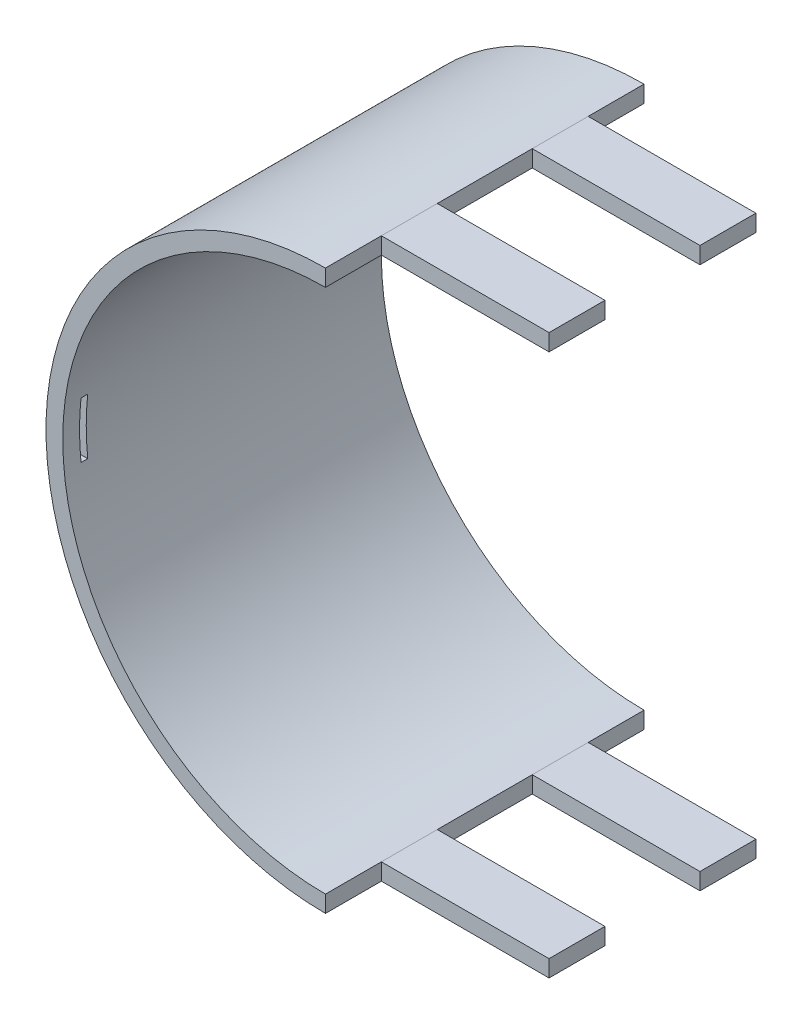
ISO-10303-21;
HEADER;
FILE_DESCRIPTION(('STEP AP214'),'2;1');
FILE_NAME('part.step','',(''),(''),'','','');
FILE_SCHEMA(('AUTOMOTIVE_DESIGN { 1 0 10303 214 1 1 1 1 }'));
ENDSEC;
DATA;
#1=APPLICATION_CONTEXT('core data for automotive mechanical design processes');
#2=APPLICATION_PROTOCOL_DEFINITION('international standard','automotive_design',2000,#1);
#3=PRODUCT_CONTEXT('',#1,'mechanical');
#4=PRODUCT('Part','Part','',(#3));
#5=PRODUCT_RELATED_PRODUCT_CATEGORY('part','',(#4));
#6=PRODUCT_DEFINITION_FORMATION('','',#4);
#7=PRODUCT_DEFINITION_CONTEXT('part definition',#1,'design');
#8=PRODUCT_DEFINITION('design','',#6,#7);
#9=PRODUCT_DEFINITION_SHAPE('','',#8);
#10=(LENGTH_UNIT() NAMED_UNIT(*) SI_UNIT(.MILLI.,.METRE.));
#11=(NAMED_UNIT(*) PLANE_ANGLE_UNIT() SI_UNIT($,.RADIAN.));
#12=(NAMED_UNIT(*) SI_UNIT($,.STERADIAN.) SOLID_ANGLE_UNIT());
#13=UNCERTAINTY_MEASURE_WITH_UNIT(LENGTH_MEASURE(1.E-05),#10,'distance_accuracy_value','');
#14=(GEOMETRIC_REPRESENTATION_CONTEXT(3) GLOBAL_UNCERTAINTY_ASSIGNED_CONTEXT((#13)) GLOBAL_UNIT_ASSIGNED_CONTEXT((#10,
#11,#12)) REPRESENTATION_CONTEXT('',''));
#15=CARTESIAN_POINT('',(0.,0.,0.));
#16=DIRECTION('',(0.,0.,1.));
#17=DIRECTION('',(1.,0.,0.));
#18=AXIS2_PLACEMENT_3D('',#15,#16,#17);
#19=CARTESIAN_POINT('',(-269.99,-4.99999999999996,55.8));
#20=DIRECTION('',(0.,-1.,0.));
#21=DIRECTION('',(0.,0.,-1.));
#22=AXIS2_PLACEMENT_3D('',#19,#20,#21);
#23=PLANE('',#22);
#24=DIRECTION('',(-1.,0.,0.));
#25=VECTOR('',#24,1.);
#26=CARTESIAN_POINT('',(-269.99,-4.99999999999996,55.8));
#27=LINE('',#26,#25);
#28=CARTESIAN_POINT('',(-346.733285782192,-4.99999999999995,55.8));
#29=VERTEX_POINT('',#28);
#30=CARTESIAN_POINT('',(-349.749371855331,-4.99999999999994,55.8));
#31=VERTEX_POINT('',#30);
#32=EDGE_CURVE('E386',#29,#31,#27,.T.);
#33=ORIENTED_EDGE('',*,*,#32,.T.);
#34=DIRECTION('',(0.,0.,-1.));
#35=VECTOR('',#34,1.);
#36=CARTESIAN_POINT('',(-349.749371855331,-4.99999999999994,60.));
#37=LINE('',#36,#35);
#38=CARTESIAN_POINT('',(-349.749371855331,-4.99999999999994,57.));
#39=VERTEX_POINT('',#38);
#40=EDGE_CURVE('E52',#39,#31,#37,.T.);
#41=ORIENTED_EDGE('',*,*,#40,.F.);
#42=DIRECTION('',(-1.,0.,0.));
#43=VECTOR('',#42,1.);
#44=CARTESIAN_POINT('',(-269.99,-4.99999999999995,57.));
#45=LINE('',#44,#43);
#46=CARTESIAN_POINT('',(-346.733285782192,-4.99999999999994,57.));
#47=VERTEX_POINT('',#46);
#48=EDGE_CURVE('E382',#47,#39,#45,.T.);
#49=ORIENTED_EDGE('',*,*,#48,.F.);
#50=DIRECTION('',(0.,0.,1.));
#51=VECTOR('',#50,1.);
#52=CARTESIAN_POINT('',(-346.733285782192,-5.00000000000006,3.00000000000001));
#53=LINE('',#52,#51);
#54=EDGE_CURVE('E39',#29,#47,#53,.T.);
#55=ORIENTED_EDGE('',*,*,#54,.F.);
#56=EDGE_LOOP('',(#33,#41,#49,#55));
#57=FACE_BOUND('',#56,.T.);
#58=ADVANCED_FACE('F35',(#57),#23,.F.);
#59=CARTESIAN_POINT('',(-269.99,0.,55.8));
#60=DIRECTION('',(0.,0.,-1.));
#61=DIRECTION('',(0.,1.,0.));
#62=AXIS2_PLACEMENT_3D('',#59,#60,#61);
#63=PLANE('',#62);
#64=DIRECTION('',(-1.,0.,0.));
#65=VECTOR('',#64,1.);
#66=CARTESIAN_POINT('',(-269.99,5.00000000000004,55.8));
#67=LINE('',#66,#65);
#68=CARTESIAN_POINT('',(-346.733285782192,5.00000000000017,55.8));
#69=VERTEX_POINT('',#68);
#70=CARTESIAN_POINT('',(-349.749371855331,5.00000000000006,55.8));
#71=VERTEX_POINT('',#70);
#72=EDGE_CURVE('E44',#69,#71,#67,.T.);
#73=ORIENTED_EDGE('',*,*,#72,.T.);
#74=CARTESIAN_POINT('',(-300.,0.,55.8));
#75=DIRECTION('',(0.,0.,-1.));
#76=DIRECTION('',(0.,1.,0.));
#77=AXIS2_PLACEMENT_3D('',#74,#75,#76);
#78=CIRCLE('',#77,50.);
#79=EDGE_CURVE('E378',#31,#71,#78,.T.);
#80=ORIENTED_EDGE('',*,*,#79,.F.);
#81=ORIENTED_EDGE('',*,*,#32,.F.);
#82=CARTESIAN_POINT('',(-300.,0.,55.8));
#83=DIRECTION('',(0.,0.,-1.));
#84=DIRECTION('',(0.,1.,0.));
#85=AXIS2_PLACEMENT_3D('',#82,#83,#84);
#86=CIRCLE('',#85,47.);
#87=EDGE_CURVE('E394',#69,#29,#86,.F.);
#88=ORIENTED_EDGE('',*,*,#87,.F.);
#89=EDGE_LOOP('',(#73,#80,#81,#88));
#90=FACE_BOUND('',#89,.T.);
#91=ADVANCED_FACE('F37',(#90),#63,.F.);
#92=CARTESIAN_POINT('',(-269.99,0.,57.));
#93=DIRECTION('',(0.,0.,1.));
#94=DIRECTION('',(1.,0.,0.));
#95=AXIS2_PLACEMENT_3D('',#92,#93,#94);
#96=PLANE('',#95);
#97=ORIENTED_EDGE('',*,*,#48,.T.);
#98=CARTESIAN_POINT('',(-300.,0.,57.));
#99=DIRECTION('',(0.,0.,1.));
#100=DIRECTION('',(1.,0.,0.));
#101=AXIS2_PLACEMENT_3D('',#98,#99,#100);
#102=CIRCLE('',#101,50.);
#103=CARTESIAN_POINT('',(-349.749371855331,5.00000000000005,57.));
#104=VERTEX_POINT('',#103);
#105=EDGE_CURVE('E360',#104,#39,#102,.T.);
#106=ORIENTED_EDGE('',*,*,#105,.F.);
#107=DIRECTION('',(-1.,0.,0.));
#108=VECTOR('',#107,1.);
#109=CARTESIAN_POINT('',(-269.99,5.00000000000004,57.));
#110=LINE('',#109,#108);
#111=CARTESIAN_POINT('',(-346.733285782192,5.00000000000017,57.));
#112=VERTEX_POINT('',#111);
#113=EDGE_CURVE('E11',#112,#104,#110,.T.);
#114=ORIENTED_EDGE('',*,*,#113,.F.);
#115=CARTESIAN_POINT('',(-300.,0.,57.));
#116=DIRECTION('',(0.,0.,1.));
#117=DIRECTION('',(1.,0.,0.));
#118=AXIS2_PLACEMENT_3D('',#115,#116,#117);
#119=CIRCLE('',#118,47.);
#120=EDGE_CURVE('E393',#47,#112,#119,.F.);
#121=ORIENTED_EDGE('',*,*,#120,.F.);
#122=EDGE_LOOP('',(#97,#106,#114,#121));
#123=FACE_BOUND('',#122,.T.);
#124=ADVANCED_FACE('F404',(#123),#96,.F.);
#125=CARTESIAN_POINT('',(-269.99,5.00000000000004,55.8));
#126=DIRECTION('',(0.,1.,0.));
#127=DIRECTION('',(0.,0.,1.));
#128=AXIS2_PLACEMENT_3D('',#125,#126,#127);
#129=PLANE('',#128);
#130=ORIENTED_EDGE('',*,*,#113,.T.);
#131=DIRECTION('',(0.,0.,-1.));
#132=VECTOR('',#131,1.);
#133=CARTESIAN_POINT('',(-349.749371855331,5.00000000000005,60.));
#134=LINE('',#133,#132);
#135=EDGE_CURVE('E388',#104,#71,#134,.T.);
#136=ORIENTED_EDGE('',*,*,#135,.T.);
#137=ORIENTED_EDGE('',*,*,#72,.F.);
#138=DIRECTION('',(0.,0.,1.));
#139=VECTOR('',#138,1.);
#140=CARTESIAN_POINT('',(-346.733285782192,5.00000000000017,3.00000000000001));
#141=LINE('',#140,#139);
#142=EDGE_CURVE('E380',#112,#69,#141,.F.);
#143=ORIENTED_EDGE('',*,*,#142,.F.);
#144=EDGE_LOOP('',(#130,#136,#137,#143));
#145=FACE_BOUND('',#144,.T.);
#146=ADVANCED_FACE('F414',(#145),#129,.F.);
#147=CARTESIAN_POINT('',(-300.,0.,60.));
#148=DIRECTION('',(0.,0.,-1.));
#149=DIRECTION('',(-1.,0.,0.));
#150=AXIS2_PLACEMENT_3D('',#147,#148,#149);
#151=CYLINDRICAL_SURFACE('',#150,50.);
#152=DIRECTION('',(0.,0.,-1.));
#153=VECTOR('',#152,1.);
#154=CARTESIAN_POINT('',(-300.,50.,60.));
#155=LINE('',#154,#153);
#156=CARTESIAN_POINT('',(-300.,50.,60.));
#157=VERTEX_POINT('',#156);
#158=CARTESIAN_POINT('',(-300.,50.,50.));
#159=VERTEX_POINT('',#158);
#160=EDGE_CURVE('E239',#157,#159,#155,.T.);
#161=ORIENTED_EDGE('',*,*,#160,.T.);
#162=DIRECTION('',(0.,0.,-1.));
#163=VECTOR('',#162,1.);
#164=CARTESIAN_POINT('',(-300.,50.,60.));
#165=LINE('',#164,#163);
#166=CARTESIAN_POINT('',(-300.,50.,40.));
#167=VERTEX_POINT('',#166);
#168=EDGE_CURVE('E343',#159,#167,#165,.T.);
#169=ORIENTED_EDGE('',*,*,#168,.T.);
#170=CARTESIAN_POINT('',(-300.,50.,23.));
#171=VERTEX_POINT('',#170);
#172=EDGE_CURVE('E262',#167,#171,#155,.T.);
#173=ORIENTED_EDGE('',*,*,#172,.T.);
#174=DIRECTION('',(0.,0.,-1.));
#175=VECTOR('',#174,1.);
#176=CARTESIAN_POINT('',(-300.,50.,60.));
#177=LINE('',#176,#175);
#178=CARTESIAN_POINT('',(-300.,50.,13.));
#179=VERTEX_POINT('',#178);
#180=EDGE_CURVE('E309',#171,#179,#177,.T.);
#181=ORIENTED_EDGE('',*,*,#180,.T.);
#182=CARTESIAN_POINT('',(-300.,50.,3.));
#183=VERTEX_POINT('',#182);
#184=EDGE_CURVE('E259',#179,#183,#155,.T.);
#185=ORIENTED_EDGE('',*,*,#184,.T.);
#186=CARTESIAN_POINT('',(-300.,0.,3.));
#187=DIRECTION('',(0.,0.,1.));
#188=DIRECTION('',(1.,0.,0.));
#189=AXIS2_PLACEMENT_3D('',#186,#187,#188);
#190=CIRCLE('',#189,50.);
#191=CARTESIAN_POINT('',(-300.,-50.,3.));
#192=VERTEX_POINT('',#191);
#193=EDGE_CURVE('E243',#183,#192,#190,.T.);
#194=ORIENTED_EDGE('',*,*,#193,.T.);
#195=DIRECTION('',(0.,0.,-1.));
#196=VECTOR('',#195,1.);
#197=CARTESIAN_POINT('',(-300.,-50.,60.));
#198=LINE('',#197,#196);
#199=CARTESIAN_POINT('',(-300.,-50.,13.));
#200=VERTEX_POINT('',#199);
#201=EDGE_CURVE('E250',#200,#192,#198,.T.);
#202=ORIENTED_EDGE('',*,*,#201,.F.);
#203=DIRECTION('',(0.,0.,-1.));
#204=VECTOR('',#203,1.);
#205=CARTESIAN_POINT('',(-300.,-50.,60.));
#206=LINE('',#205,#204);
#207=CARTESIAN_POINT('',(-300.,-50.,23.));
#208=VERTEX_POINT('',#207);
#209=EDGE_CURVE('E225',#208,#200,#206,.T.);
#210=ORIENTED_EDGE('',*,*,#209,.F.);
#211=CARTESIAN_POINT('',(-300.,-50.,40.));
#212=VERTEX_POINT('',#211);
#213=EDGE_CURVE('E249',#212,#208,#198,.T.);
#214=ORIENTED_EDGE('',*,*,#213,.F.);
#215=DIRECTION('',(0.,0.,-1.));
#216=VECTOR('',#215,1.);
#217=CARTESIAN_POINT('',(-300.,-50.,60.));
#218=LINE('',#217,#216);
#219=CARTESIAN_POINT('',(-300.,-50.,50.));
#220=VERTEX_POINT('',#219);
#221=EDGE_CURVE('E290',#220,#212,#218,.T.);
#222=ORIENTED_EDGE('',*,*,#221,.F.);
#223=CARTESIAN_POINT('',(-300.,-50.,60.));
#224=VERTEX_POINT('',#223);
#225=EDGE_CURVE('E245',#224,#220,#198,.T.);
#226=ORIENTED_EDGE('',*,*,#225,.F.);
#227=CARTESIAN_POINT('',(-300.,0.,60.));
#228=DIRECTION('',(0.,0.,1.));
#229=DIRECTION('',(1.,0.,0.));
#230=AXIS2_PLACEMENT_3D('',#227,#228,#229);
#231=CIRCLE('',#230,50.);
#232=EDGE_CURVE('E235',#157,#224,#231,.T.);
#233=ORIENTED_EDGE('',*,*,#232,.F.);
#234=EDGE_LOOP('',(#161,#169,#173,#181,#185,#194,#202,#210,#214,#222,#226,#233));
#235=FACE_BOUND('',#234,.T.);
#236=ORIENTED_EDGE('',*,*,#79,.T.);
#237=ORIENTED_EDGE('',*,*,#135,.F.);
#238=ORIENTED_EDGE('',*,*,#105,.T.);
#239=ORIENTED_EDGE('',*,*,#40,.T.);
#240=EDGE_LOOP('',(#236,#237,#238,#239));
#241=FACE_BOUND('',#240,.T.);
#242=ADVANCED_FACE('F417',(#235,#241),#151,.T.);
#243=CARTESIAN_POINT('',(-300.,-47.,3.));
#244=DIRECTION('',(0.,-1.,0.));
#245=DIRECTION('',(0.,0.,-1.));
#246=AXIS2_PLACEMENT_3D('',#243,#244,#245);
#247=PLANE('',#246);
#248=DIRECTION('',(-1.,0.,0.));
#249=VECTOR('',#248,1.);
#250=CARTESIAN_POINT('',(-300.,-47.,23.));
#251=LINE('',#250,#249);
#252=CARTESIAN_POINT('',(-270.,-47.,23.));
#253=VERTEX_POINT('',#252);
#254=CARTESIAN_POINT('',(-300.,-47.,23.));
#255=VERTEX_POINT('',#254);
#256=EDGE_CURVE('E229',#253,#255,#251,.T.);
#257=ORIENTED_EDGE('',*,*,#256,.F.);
#258=DIRECTION('',(0.,0.,1.));
#259=VECTOR('',#258,1.);
#260=CARTESIAN_POINT('',(-270.,-47.,3.));
#261=LINE('',#260,#259);
#262=CARTESIAN_POINT('',(-270.,-47.,13.));
#263=VERTEX_POINT('',#262);
#264=EDGE_CURVE('E201',#263,#253,#261,.T.);
#265=ORIENTED_EDGE('',*,*,#264,.F.);
#266=DIRECTION('',(1.,0.,0.));
#267=VECTOR('',#266,1.);
#268=CARTESIAN_POINT('',(-300.,-47.,13.));
#269=LINE('',#268,#267);
#270=CARTESIAN_POINT('',(-300.,-47.,13.));
#271=VERTEX_POINT('',#270);
#272=EDGE_CURVE('E232',#271,#263,#269,.T.);
#273=ORIENTED_EDGE('',*,*,#272,.F.);
#274=DIRECTION('',(0.,0.,1.));
#275=VECTOR('',#274,1.);
#276=CARTESIAN_POINT('',(-300.,-47.,3.));
#277=LINE('',#276,#275);
#278=EDGE_CURVE('E206',#271,#255,#277,.T.);
#279=ORIENTED_EDGE('',*,*,#278,.T.);
#280=EDGE_LOOP('',(#257,#265,#273,#279));
#281=FACE_BOUND('',#280,.T.);
#282=ADVANCED_FACE('F465',(#281),#247,.F.);
#283=CARTESIAN_POINT('',(-300.,-47.,3.));
#284=DIRECTION('',(0.,-1.,0.));
#285=DIRECTION('',(0.,0.,-1.));
#286=AXIS2_PLACEMENT_3D('',#283,#284,#285);
#287=PLANE('',#286);
#288=DIRECTION('',(-1.,0.,0.));
#289=VECTOR('',#288,1.);
#290=CARTESIAN_POINT('',(-300.,-47.,50.));
#291=LINE('',#290,#289);
#292=CARTESIAN_POINT('',(-270.,-47.,50.));
#293=VERTEX_POINT('',#292);
#294=CARTESIAN_POINT('',(-300.,-47.,50.));
#295=VERTEX_POINT('',#294);
#296=EDGE_CURVE('E302',#293,#295,#291,.T.);
#297=ORIENTED_EDGE('',*,*,#296,.F.);
#298=DIRECTION('',(0.,0.,1.));
#299=VECTOR('',#298,1.);
#300=CARTESIAN_POINT('',(-270.,-47.,3.));
#301=LINE('',#300,#299);
#302=CARTESIAN_POINT('',(-270.,-47.,40.));
#303=VERTEX_POINT('',#302);
#304=EDGE_CURVE('E304',#303,#293,#301,.T.);
#305=ORIENTED_EDGE('',*,*,#304,.F.);
#306=DIRECTION('',(1.,0.,0.));
#307=VECTOR('',#306,1.);
#308=CARTESIAN_POINT('',(-300.,-47.,40.));
#309=LINE('',#308,#307);
#310=CARTESIAN_POINT('',(-300.,-47.,40.));
#311=VERTEX_POINT('',#310);
#312=EDGE_CURVE('E275',#311,#303,#309,.T.);
#313=ORIENTED_EDGE('',*,*,#312,.F.);
#314=DIRECTION('',(0.,0.,1.));
#315=VECTOR('',#314,1.);
#316=CARTESIAN_POINT('',(-300.,-47.,3.));
#317=LINE('',#316,#315);
#318=EDGE_CURVE('E282',#311,#295,#317,.T.);
#319=ORIENTED_EDGE('',*,*,#318,.T.);
#320=EDGE_LOOP('',(#297,#305,#313,#319));
#321=FACE_BOUND('',#320,.T.);
#322=ADVANCED_FACE('F438',(#321),#287,.F.);
#323=CARTESIAN_POINT('',(300.,47.,3.));
#324=DIRECTION('',(0.,1.,0.));
#325=DIRECTION('',(0.,0.,1.));
#326=AXIS2_PLACEMENT_3D('',#323,#324,#325);
#327=PLANE('',#326);
#328=DIRECTION('',(1.,0.,0.));
#329=VECTOR('',#328,1.);
#330=CARTESIAN_POINT('',(300.,47.,50.));
#331=LINE('',#330,#329);
#332=CARTESIAN_POINT('',(-300.,47.,50.));
#333=VERTEX_POINT('',#332);
#334=CARTESIAN_POINT('',(-270.,47.,50.));
#335=VERTEX_POINT('',#334);
#336=EDGE_CURVE('E356',#333,#335,#331,.T.);
#337=ORIENTED_EDGE('',*,*,#336,.F.);
#338=DIRECTION('',(0.,0.,1.));
#339=VECTOR('',#338,1.);
#340=CARTESIAN_POINT('',(-300.,47.,3.));
#341=LINE('',#340,#339);
#342=CARTESIAN_POINT('',(-300.,47.,39.9999999999999));
#343=VERTEX_POINT('',#342);
#344=EDGE_CURVE('E346',#343,#333,#341,.T.);
#345=ORIENTED_EDGE('',*,*,#344,.F.);
#346=DIRECTION('',(-1.,0.,0.));
#347=VECTOR('',#346,1.);
#348=CARTESIAN_POINT('',(300.,47.,40.));
#349=LINE('',#348,#347);
#350=CARTESIAN_POINT('',(-270.,47.,40.));
#351=VERTEX_POINT('',#350);
#352=EDGE_CURVE('E366',#351,#343,#349,.T.);
#353=ORIENTED_EDGE('',*,*,#352,.F.);
#354=DIRECTION('',(0.,0.,-1.));
#355=VECTOR('',#354,1.);
#356=CARTESIAN_POINT('',(-270.,47.,3.));
#357=LINE('',#356,#355);
#358=EDGE_CURVE('E371',#335,#351,#357,.T.);
#359=ORIENTED_EDGE('',*,*,#358,.F.);
#360=EDGE_LOOP('',(#337,#345,#353,#359));
#361=FACE_BOUND('',#360,.T.);
#362=ADVANCED_FACE('F434',(#361),#327,.F.);
#363=CARTESIAN_POINT('',(300.,47.,3.));
#364=DIRECTION('',(0.,1.,0.));
#365=DIRECTION('',(0.,0.,1.));
#366=AXIS2_PLACEMENT_3D('',#363,#364,#365);
#367=PLANE('',#366);
#368=DIRECTION('',(1.,0.,0.));
#369=VECTOR('',#368,1.);
#370=CARTESIAN_POINT('',(300.,47.,22.9999999999999));
#371=LINE('',#370,#369);
#372=CARTESIAN_POINT('',(-300.,47.,23.));
#373=VERTEX_POINT('',#372);
#374=CARTESIAN_POINT('',(-270.,47.,23.));
#375=VERTEX_POINT('',#374);
#376=EDGE_CURVE('E331',#373,#375,#371,.T.);
#377=ORIENTED_EDGE('',*,*,#376,.F.);
#378=DIRECTION('',(0.,0.,1.));
#379=VECTOR('',#378,1.);
#380=CARTESIAN_POINT('',(-300.,47.,3.));
#381=LINE('',#380,#379);
#382=CARTESIAN_POINT('',(-300.,47.,13.));
#383=VERTEX_POINT('',#382);
#384=EDGE_CURVE('E313',#383,#373,#381,.T.);
#385=ORIENTED_EDGE('',*,*,#384,.F.);
#386=DIRECTION('',(-1.,0.,0.));
#387=VECTOR('',#386,1.);
#388=CARTESIAN_POINT('',(300.,47.,13.));
#389=LINE('',#388,#387);
#390=CARTESIAN_POINT('',(-270.,47.,13.));
#391=VERTEX_POINT('',#390);
#392=EDGE_CURVE('E325',#391,#383,#389,.T.);
#393=ORIENTED_EDGE('',*,*,#392,.F.);
#394=DIRECTION('',(0.,0.,-1.));
#395=VECTOR('',#394,1.);
#396=CARTESIAN_POINT('',(-270.,47.,3.));
#397=LINE('',#396,#395);
#398=EDGE_CURVE('E328',#375,#391,#397,.T.);
#399=ORIENTED_EDGE('',*,*,#398,.F.);
#400=EDGE_LOOP('',(#377,#385,#393,#399));
#401=FACE_BOUND('',#400,.T.);
#402=ADVANCED_FACE('F437',(#401),#367,.F.);
#403=CARTESIAN_POINT('',(-300.,46.99,13.));
#404=DIRECTION('',(0.,0.,-1.));
#405=DIRECTION('',(-1.,0.,0.));
#406=AXIS2_PLACEMENT_3D('',#403,#404,#405);
#407=PLANE('',#406);
#408=DIRECTION('',(0.,1.,0.));
#409=VECTOR('',#408,1.);
#410=CARTESIAN_POINT('',(-270.,46.99,13.));
#411=LINE('',#410,#409);
#412=CARTESIAN_POINT('',(-270.,50.,13.));
#413=VERTEX_POINT('',#412);
#414=EDGE_CURVE('E340',#391,#413,#411,.T.);
#415=ORIENTED_EDGE('',*,*,#414,.F.);
#416=ORIENTED_EDGE('',*,*,#392,.T.);
#417=DIRECTION('',(0.,-1.,0.));
#418=VECTOR('',#417,1.);
#419=CARTESIAN_POINT('',(-300.,0.,13.));
#420=LINE('',#419,#418);
#421=EDGE_CURVE('E316',#179,#383,#420,.T.);
#422=ORIENTED_EDGE('',*,*,#421,.F.);
#423=DIRECTION('',(1.,0.,0.));
#424=VECTOR('',#423,1.);
#425=CARTESIAN_POINT('',(-300.,50.,13.));
#426=LINE('',#425,#424);
#427=EDGE_CURVE('E279',#179,#413,#426,.T.);
#428=ORIENTED_EDGE('',*,*,#427,.T.);
#429=EDGE_LOOP('',(#415,#416,#422,#428));
#430=FACE_BOUND('',#429,.T.);
#431=ADVANCED_FACE('F445',(#430),#407,.T.);
#432=CARTESIAN_POINT('',(-300.,0.,0.));
#433=DIRECTION('',(-1.,0.,0.));
#434=DIRECTION('',(0.,0.,1.));
#435=AXIS2_PLACEMENT_3D('',#432,#433,#434);
#436=PLANE('',#435);
#437=ORIENTED_EDGE('',*,*,#184,.F.);
#438=ORIENTED_EDGE('',*,*,#421,.T.);
#439=DIRECTION('',(0.,0.,1.));
#440=VECTOR('',#439,1.);
#441=CARTESIAN_POINT('',(-300.,47.,3.));
#442=LINE('',#441,#440);
#443=CARTESIAN_POINT('',(-300.,47.,3.));
#444=VERTEX_POINT('',#443);
#445=EDGE_CURVE('E244',#444,#383,#442,.T.);
#446=ORIENTED_EDGE('',*,*,#445,.F.);
#447=DIRECTION('',(0.,1.,0.));
#448=VECTOR('',#447,1.);
#449=CARTESIAN_POINT('',(-300.,0.,3.));
#450=LINE('',#449,#448);
#451=EDGE_CURVE('E272',#444,#183,#450,.T.);
#452=ORIENTED_EDGE('',*,*,#451,.T.);
#453=EDGE_LOOP('',(#437,#438,#446,#452));
#454=FACE_BOUND('',#453,.T.);
#455=ADVANCED_FACE('F461',(#454),#436,.F.);
#456=CARTESIAN_POINT('',(-270.,-50.01,40.));
#457=DIRECTION('',(1.,0.,0.));
#458=DIRECTION('',(0.,0.,-1.));
#459=AXIS2_PLACEMENT_3D('',#456,#457,#458);
#460=PLANE('',#459);
#461=DIRECTION('',(0.,1.,0.));
#462=VECTOR('',#461,1.);
#463=CARTESIAN_POINT('',(-270.,-50.01,50.));
#464=LINE('',#463,#462);
#465=CARTESIAN_POINT('',(-270.,-50.,50.));
#466=VERTEX_POINT('',#465);
#467=EDGE_CURVE('E280',#466,#293,#464,.T.);
#468=ORIENTED_EDGE('',*,*,#467,.F.);
#469=DIRECTION('',(0.,0.,-1.));
#470=VECTOR('',#469,1.);
#471=CARTESIAN_POINT('',(-270.,-50.,60.));
#472=LINE('',#471,#470);
#473=CARTESIAN_POINT('',(-270.,-50.,40.));
#474=VERTEX_POINT('',#473);
#475=EDGE_CURVE('E296',#466,#474,#472,.T.);
#476=ORIENTED_EDGE('',*,*,#475,.T.);
#477=DIRECTION('',(0.,1.,0.));
#478=VECTOR('',#477,1.);
#479=CARTESIAN_POINT('',(-270.,-50.01,40.));
#480=LINE('',#479,#478);
#481=EDGE_CURVE('E277',#474,#303,#480,.T.);
#482=ORIENTED_EDGE('',*,*,#481,.T.);
#483=ORIENTED_EDGE('',*,*,#304,.T.);
#484=EDGE_LOOP('',(#468,#476,#482,#483));
#485=FACE_BOUND('',#484,.T.);
#486=ADVANCED_FACE('F472',(#485),#460,.T.);
#487=CARTESIAN_POINT('',(-300.,-50.01,40.));
#488=DIRECTION('',(0.,0.,-1.));
#489=DIRECTION('',(-1.,0.,0.));
#490=AXIS2_PLACEMENT_3D('',#487,#488,#489);
#491=PLANE('',#490);
#492=ORIENTED_EDGE('',*,*,#481,.F.);
#493=DIRECTION('',(-1.,0.,0.));
#494=VECTOR('',#493,1.);
#495=CARTESIAN_POINT('',(-300.,-50.,40.));
#496=LINE('',#495,#494);
#497=EDGE_CURVE('E299',#474,#212,#496,.T.);
#498=ORIENTED_EDGE('',*,*,#497,.T.);
#499=DIRECTION('',(0.,-1.,0.));
#500=VECTOR('',#499,1.);
#501=CARTESIAN_POINT('',(-300.,0.,40.));
#502=LINE('',#501,#500);
#503=EDGE_CURVE('E286',#311,#212,#502,.T.);
#504=ORIENTED_EDGE('',*,*,#503,.F.);
#505=ORIENTED_EDGE('',*,*,#312,.T.);
#506=EDGE_LOOP('',(#492,#498,#504,#505));
#507=FACE_BOUND('',#506,.T.);
#508=ADVANCED_FACE('F475',(#507),#491,.T.);
#509=CARTESIAN_POINT('',(-300.,-50.01,50.));
#510=DIRECTION('',(0.,0.,1.));
#511=DIRECTION('',(1.,0.,0.));
#512=AXIS2_PLACEMENT_3D('',#509,#510,#511);
#513=PLANE('',#512);
#514=DIRECTION('',(0.,1.,0.));
#515=VECTOR('',#514,1.);
#516=CARTESIAN_POINT('',(-300.,0.,50.));
#517=LINE('',#516,#515);
#518=EDGE_CURVE('E283',#220,#295,#517,.T.);
#519=ORIENTED_EDGE('',*,*,#518,.F.);
#520=DIRECTION('',(1.,0.,0.));
#521=VECTOR('',#520,1.);
#522=CARTESIAN_POINT('',(-300.,-50.,50.));
#523=LINE('',#522,#521);
#524=EDGE_CURVE('E287',#220,#466,#523,.T.);
#525=ORIENTED_EDGE('',*,*,#524,.T.);
#526=ORIENTED_EDGE('',*,*,#467,.T.);
#527=ORIENTED_EDGE('',*,*,#296,.T.);
#528=EDGE_LOOP('',(#519,#525,#526,#527));
#529=FACE_BOUND('',#528,.T.);
#530=ADVANCED_FACE('F479',(#529),#513,.T.);
#531=CARTESIAN_POINT('',(0.,0.,3.));
#532=DIRECTION('',(0.,0.,1.));
#533=DIRECTION('',(1.,0.,0.));
#534=AXIS2_PLACEMENT_3D('',#531,#532,#533);
#535=PLANE('',#534);
#536=DIRECTION('',(0.,1.,0.));
#537=VECTOR('',#536,1.);
#538=CARTESIAN_POINT('',(-300.,0.,3.));
#539=LINE('',#538,#537);
#540=CARTESIAN_POINT('',(-300.,-47.,3.));
#541=VERTEX_POINT('',#540);
#542=EDGE_CURVE('E269',#192,#541,#539,.T.);
#543=ORIENTED_EDGE('',*,*,#542,.F.);
#544=ORIENTED_EDGE('',*,*,#193,.F.);
#545=ORIENTED_EDGE('',*,*,#451,.F.);
#546=CARTESIAN_POINT('',(-300.,0.,3.));
#547=DIRECTION('',(0.,0.,1.));
#548=DIRECTION('',(1.,0.,0.));
#549=AXIS2_PLACEMENT_3D('',#546,#547,#548);
#550=CIRCLE('',#549,47.);
#551=EDGE_CURVE('E268',#541,#444,#550,.F.);
#552=ORIENTED_EDGE('',*,*,#551,.F.);
#553=EDGE_LOOP('',(#543,#544,#545,#552));
#554=FACE_BOUND('',#553,.T.);
#555=ADVANCED_FACE('F483',(#554),#535,.F.);
#556=CARTESIAN_POINT('',(-270.,-50.01,13.));
#557=DIRECTION('',(1.,0.,0.));
#558=DIRECTION('',(0.,0.,-1.));
#559=AXIS2_PLACEMENT_3D('',#556,#557,#558);
#560=PLANE('',#559);
#561=DIRECTION('',(0.,1.,0.));
#562=VECTOR('',#561,1.);
#563=CARTESIAN_POINT('',(-270.,-50.01,23.));
#564=LINE('',#563,#562);
#565=CARTESIAN_POINT('',(-270.,-50.,23.));
#566=VERTEX_POINT('',#565);
#567=EDGE_CURVE('E196',#566,#253,#564,.T.);
#568=ORIENTED_EDGE('',*,*,#567,.F.);
#569=DIRECTION('',(0.,0.,-1.));
#570=VECTOR('',#569,1.);
#571=CARTESIAN_POINT('',(-270.,-50.,60.));
#572=LINE('',#571,#570);
#573=CARTESIAN_POINT('',(-270.,-50.,13.));
#574=VERTEX_POINT('',#573);
#575=EDGE_CURVE('E199',#566,#574,#572,.T.);
#576=ORIENTED_EDGE('',*,*,#575,.T.);
#577=DIRECTION('',(0.,1.,0.));
#578=VECTOR('',#577,1.);
#579=CARTESIAN_POINT('',(-270.,-50.01,13.));
#580=LINE('',#579,#578);
#581=EDGE_CURVE('E205',#574,#263,#580,.T.);
#582=ORIENTED_EDGE('',*,*,#581,.T.);
#583=ORIENTED_EDGE('',*,*,#264,.T.);
#584=EDGE_LOOP('',(#568,#576,#582,#583));
#585=FACE_BOUND('',#584,.T.);
#586=ADVANCED_FACE('F198',(#585),#560,.T.);
#587=CARTESIAN_POINT('',(-300.,-50.01,13.));
#588=DIRECTION('',(0.,0.,-1.));
#589=DIRECTION('',(-1.,0.,0.));
#590=AXIS2_PLACEMENT_3D('',#587,#588,#589);
#591=PLANE('',#590);
#592=ORIENTED_EDGE('',*,*,#581,.F.);
#593=DIRECTION('',(-1.,0.,0.));
#594=VECTOR('',#593,1.);
#595=CARTESIAN_POINT('',(-300.,-50.,13.));
#596=LINE('',#595,#594);
#597=EDGE_CURVE('E215',#574,#200,#596,.T.);
#598=ORIENTED_EDGE('',*,*,#597,.T.);
#599=DIRECTION('',(0.,-1.,0.));
#600=VECTOR('',#599,1.);
#601=CARTESIAN_POINT('',(-300.,0.,13.));
#602=LINE('',#601,#600);
#603=EDGE_CURVE('E222',#271,#200,#602,.T.);
#604=ORIENTED_EDGE('',*,*,#603,.F.);
#605=ORIENTED_EDGE('',*,*,#272,.T.);
#606=EDGE_LOOP('',(#592,#598,#604,#605));
#607=FACE_BOUND('',#606,.T.);
#608=ADVANCED_FACE('F509',(#607),#591,.T.);
#609=CARTESIAN_POINT('',(-300.,-50.01,23.));
#610=DIRECTION('',(0.,0.,1.));
#611=DIRECTION('',(1.,0.,0.));
#612=AXIS2_PLACEMENT_3D('',#609,#610,#611);
#613=PLANE('',#612);
#614=DIRECTION('',(0.,1.,0.));
#615=VECTOR('',#614,1.);
#616=CARTESIAN_POINT('',(-300.,0.,23.));
#617=LINE('',#616,#615);
#618=EDGE_CURVE('E220',#208,#255,#617,.T.);
#619=ORIENTED_EDGE('',*,*,#618,.F.);
#620=DIRECTION('',(1.,0.,0.));
#621=VECTOR('',#620,1.);
#622=CARTESIAN_POINT('',(-300.,-50.,23.));
#623=LINE('',#622,#621);
#624=EDGE_CURVE('E212',#208,#566,#623,.T.);
#625=ORIENTED_EDGE('',*,*,#624,.T.);
#626=ORIENTED_EDGE('',*,*,#567,.T.);
#627=ORIENTED_EDGE('',*,*,#256,.T.);
#628=EDGE_LOOP('',(#619,#625,#626,#627));
#629=FACE_BOUND('',#628,.T.);
#630=ADVANCED_FACE('F218',(#629),#613,.T.);
#631=CARTESIAN_POINT('',(-300.,-50.,60.));
#632=DIRECTION('',(0.,1.,0.));
#633=DIRECTION('',(0.,0.,1.));
#634=AXIS2_PLACEMENT_3D('',#631,#632,#633);
#635=PLANE('',#634);
#636=ORIENTED_EDGE('',*,*,#624,.F.);
#637=ORIENTED_EDGE('',*,*,#209,.T.);
#638=ORIENTED_EDGE('',*,*,#597,.F.);
#639=ORIENTED_EDGE('',*,*,#575,.F.);
#640=EDGE_LOOP('',(#636,#637,#638,#639));
#641=FACE_BOUND('',#640,.T.);
#642=ADVANCED_FACE('F211',(#641),#635,.F.);
#643=CARTESIAN_POINT('',(-300.,0.,3.));
#644=DIRECTION('',(0.,0.,1.));
#645=DIRECTION('',(1.,0.,0.));
#646=AXIS2_PLACEMENT_3D('',#643,#644,#645);
#647=CYLINDRICAL_SURFACE('',#646,47.);
#648=ORIENTED_EDGE('',*,*,#87,.T.);
#649=ORIENTED_EDGE('',*,*,#54,.T.);
#650=ORIENTED_EDGE('',*,*,#120,.T.);
#651=ORIENTED_EDGE('',*,*,#142,.T.);
#652=EDGE_LOOP('',(#648,#649,#650,#651));
#653=FACE_BOUND('',#652,.T.);
#654=DIRECTION('',(0.,0.,1.));
#655=VECTOR('',#654,1.);
#656=CARTESIAN_POINT('',(-300.,-47.,3.));
#657=LINE('',#656,#655);
#658=EDGE_CURVE('E251',#541,#271,#657,.T.);
#659=ORIENTED_EDGE('',*,*,#658,.F.);
#660=ORIENTED_EDGE('',*,*,#551,.T.);
#661=ORIENTED_EDGE('',*,*,#445,.T.);
#662=ORIENTED_EDGE('',*,*,#384,.T.);
#663=EDGE_CURVE('E265',#373,#343,#442,.T.);
#664=ORIENTED_EDGE('',*,*,#663,.T.);
#665=ORIENTED_EDGE('',*,*,#344,.T.);
#666=CARTESIAN_POINT('',(-300.,47.,60.));
#667=VERTEX_POINT('',#666);
#668=EDGE_CURVE('E238',#333,#667,#442,.T.);
#669=ORIENTED_EDGE('',*,*,#668,.T.);
#670=CARTESIAN_POINT('',(-300.,0.,60.));
#671=DIRECTION('',(0.,0.,1.));
#672=DIRECTION('',(1.,0.,0.));
#673=AXIS2_PLACEMENT_3D('',#670,#671,#672);
#674=CIRCLE('',#673,47.);
#675=CARTESIAN_POINT('',(-300.,-47.,60.));
#676=VERTEX_POINT('',#675);
#677=EDGE_CURVE('E240',#667,#676,#674,.T.);
#678=ORIENTED_EDGE('',*,*,#677,.T.);
#679=EDGE_CURVE('E255',#295,#676,#657,.T.);
#680=ORIENTED_EDGE('',*,*,#679,.F.);
#681=ORIENTED_EDGE('',*,*,#318,.F.);
#682=EDGE_CURVE('E254',#255,#311,#657,.T.);
#683=ORIENTED_EDGE('',*,*,#682,.F.);
#684=ORIENTED_EDGE('',*,*,#278,.F.);
#685=EDGE_LOOP('',(#659,#660,#661,#662,#664,#665,#669,#678,#680,#681,#683,#684));
#686=FACE_BOUND('',#685,.T.);
#687=ADVANCED_FACE('F399',(#653,#686),#647,.F.);
#688=ORIENTED_EDGE('',*,*,#658,.T.);
#689=ORIENTED_EDGE('',*,*,#603,.T.);
#690=ORIENTED_EDGE('',*,*,#201,.T.);
#691=ORIENTED_EDGE('',*,*,#542,.T.);
#692=EDGE_LOOP('',(#688,#689,#690,#691));
#693=FACE_BOUND('',#692,.T.);
#694=ADVANCED_FACE('F492',(#693),#436,.F.);
#695=ORIENTED_EDGE('',*,*,#225,.T.);
#696=ORIENTED_EDGE('',*,*,#518,.T.);
#697=ORIENTED_EDGE('',*,*,#679,.T.);
#698=DIRECTION('',(0.,-1.,0.));
#699=VECTOR('',#698,1.);
#700=CARTESIAN_POINT('',(-300.,0.,60.));
#701=LINE('',#700,#699);
#702=EDGE_CURVE('E248',#676,#224,#701,.T.);
#703=ORIENTED_EDGE('',*,*,#702,.T.);
#704=EDGE_LOOP('',(#695,#696,#697,#703));
#705=FACE_BOUND('',#704,.T.);
#706=ADVANCED_FACE('F495',(#705),#436,.F.);
#707=ORIENTED_EDGE('',*,*,#668,.F.);
#708=DIRECTION('',(0.,1.,0.));
#709=VECTOR('',#708,1.);
#710=CARTESIAN_POINT('',(-300.,0.,50.));
#711=LINE('',#710,#709);
#712=EDGE_CURVE('E353',#333,#159,#711,.T.);
#713=ORIENTED_EDGE('',*,*,#712,.T.);
#714=ORIENTED_EDGE('',*,*,#160,.F.);
#715=EDGE_CURVE('E256',#157,#667,#701,.T.);
#716=ORIENTED_EDGE('',*,*,#715,.T.);
#717=EDGE_LOOP('',(#707,#713,#714,#716));
#718=FACE_BOUND('',#717,.T.);
#719=ADVANCED_FACE('F490',(#718),#436,.F.);
#720=CARTESIAN_POINT('',(-300.,0.,60.));
#721=DIRECTION('',(0.,0.,1.));
#722=DIRECTION('',(1.,0.,0.));
#723=AXIS2_PLACEMENT_3D('',#720,#721,#722);
#724=PLANE('',#723);
#725=ORIENTED_EDGE('',*,*,#715,.F.);
#726=ORIENTED_EDGE('',*,*,#232,.T.);
#727=ORIENTED_EDGE('',*,*,#702,.F.);
#728=ORIENTED_EDGE('',*,*,#677,.F.);
#729=EDGE_LOOP('',(#725,#726,#727,#728));
#730=FACE_BOUND('',#729,.T.);
#731=ADVANCED_FACE('F470',(#730),#724,.T.);
#732=CARTESIAN_POINT('',(-300.,-50.,60.));
#733=DIRECTION('',(0.,1.,0.));
#734=DIRECTION('',(0.,0.,1.));
#735=AXIS2_PLACEMENT_3D('',#732,#733,#734);
#736=PLANE('',#735);
#737=ORIENTED_EDGE('',*,*,#524,.F.);
#738=ORIENTED_EDGE('',*,*,#221,.T.);
#739=ORIENTED_EDGE('',*,*,#497,.F.);
#740=ORIENTED_EDGE('',*,*,#475,.F.);
#741=EDGE_LOOP('',(#737,#738,#739,#740));
#742=FACE_BOUND('',#741,.T.);
#743=ADVANCED_FACE('F467',(#742),#736,.F.);
#744=ORIENTED_EDGE('',*,*,#682,.T.);
#745=ORIENTED_EDGE('',*,*,#503,.T.);
#746=ORIENTED_EDGE('',*,*,#213,.T.);
#747=ORIENTED_EDGE('',*,*,#618,.T.);
#748=EDGE_LOOP('',(#744,#745,#746,#747));
#749=FACE_BOUND('',#748,.T.);
#750=ADVANCED_FACE('F457',(#749),#436,.F.);
#751=CARTESIAN_POINT('',(-270.,46.99,13.));
#752=DIRECTION('',(1.,0.,0.));
#753=DIRECTION('',(0.,0.,-1.));
#754=AXIS2_PLACEMENT_3D('',#751,#752,#753);
#755=PLANE('',#754);
#756=DIRECTION('',(0.,1.,0.));
#757=VECTOR('',#756,1.);
#758=CARTESIAN_POINT('',(-270.,46.99,23.));
#759=LINE('',#758,#757);
#760=CARTESIAN_POINT('',(-270.,50.,23.));
#761=VERTEX_POINT('',#760);
#762=EDGE_CURVE('E312',#375,#761,#759,.T.);
#763=ORIENTED_EDGE('',*,*,#762,.F.);
#764=ORIENTED_EDGE('',*,*,#398,.T.);
#765=ORIENTED_EDGE('',*,*,#414,.T.);
#766=DIRECTION('',(0.,0.,1.));
#767=VECTOR('',#766,1.);
#768=CARTESIAN_POINT('',(-270.,50.,60.));
#769=LINE('',#768,#767);
#770=EDGE_CURVE('E319',#413,#761,#769,.T.);
#771=ORIENTED_EDGE('',*,*,#770,.T.);
#772=EDGE_LOOP('',(#763,#764,#765,#771));
#773=FACE_BOUND('',#772,.T.);
#774=ADVANCED_FACE('F453',(#773),#755,.T.);
#775=CARTESIAN_POINT('',(-300.,46.99,23.));
#776=DIRECTION('',(0.,0.,1.));
#777=DIRECTION('',(1.,0.,0.));
#778=AXIS2_PLACEMENT_3D('',#775,#776,#777);
#779=PLANE('',#778);
#780=DIRECTION('',(0.,1.,0.));
#781=VECTOR('',#780,1.);
#782=CARTESIAN_POINT('',(-300.,0.,23.));
#783=LINE('',#782,#781);
#784=EDGE_CURVE('E334',#373,#171,#783,.T.);
#785=ORIENTED_EDGE('',*,*,#784,.F.);
#786=ORIENTED_EDGE('',*,*,#376,.T.);
#787=ORIENTED_EDGE('',*,*,#762,.T.);
#788=DIRECTION('',(-1.,0.,0.));
#789=VECTOR('',#788,1.);
#790=CARTESIAN_POINT('',(-300.,50.,23.));
#791=LINE('',#790,#789);
#792=EDGE_CURVE('E322',#761,#171,#791,.T.);
#793=ORIENTED_EDGE('',*,*,#792,.T.);
#794=EDGE_LOOP('',(#785,#786,#787,#793));
#795=FACE_BOUND('',#794,.T.);
#796=ADVANCED_FACE('F449',(#795),#779,.T.);
#797=CARTESIAN_POINT('',(-300.,50.,60.));
#798=DIRECTION('',(0.,-1.,0.));
#799=DIRECTION('',(0.,0.,-1.));
#800=AXIS2_PLACEMENT_3D('',#797,#798,#799);
#801=PLANE('',#800);
#802=ORIENTED_EDGE('',*,*,#792,.F.);
#803=ORIENTED_EDGE('',*,*,#770,.F.);
#804=ORIENTED_EDGE('',*,*,#427,.F.);
#805=ORIENTED_EDGE('',*,*,#180,.F.);
#806=EDGE_LOOP('',(#802,#803,#804,#805));
#807=FACE_BOUND('',#806,.T.);
#808=ADVANCED_FACE('F432',(#807),#801,.F.);
#809=CARTESIAN_POINT('',(-300.,46.99,40.));
#810=DIRECTION('',(0.,0.,-1.));
#811=DIRECTION('',(-1.,0.,0.));
#812=AXIS2_PLACEMENT_3D('',#809,#810,#811);
#813=PLANE('',#812);
#814=DIRECTION('',(0.,1.,0.));
#815=VECTOR('',#814,1.);
#816=CARTESIAN_POINT('',(-270.,46.99,40.));
#817=LINE('',#816,#815);
#818=CARTESIAN_POINT('',(-270.,50.,40.));
#819=VERTEX_POINT('',#818);
#820=EDGE_CURVE('E342',#351,#819,#817,.T.);
#821=ORIENTED_EDGE('',*,*,#820,.F.);
#822=ORIENTED_EDGE('',*,*,#352,.T.);
#823=DIRECTION('',(0.,-1.,0.));
#824=VECTOR('',#823,1.);
#825=CARTESIAN_POINT('',(-300.,0.,40.));
#826=LINE('',#825,#824);
#827=EDGE_CURVE('E350',#167,#343,#826,.T.);
#828=ORIENTED_EDGE('',*,*,#827,.F.);
#829=DIRECTION('',(1.,0.,0.));
#830=VECTOR('',#829,1.);
#831=CARTESIAN_POINT('',(-300.,50.,40.));
#832=LINE('',#831,#830);
#833=EDGE_CURVE('E357',#167,#819,#832,.T.);
#834=ORIENTED_EDGE('',*,*,#833,.T.);
#835=EDGE_LOOP('',(#821,#822,#828,#834));
#836=FACE_BOUND('',#835,.T.);
#837=ADVANCED_FACE('F429',(#836),#813,.T.);
#838=ORIENTED_EDGE('',*,*,#172,.F.);
#839=ORIENTED_EDGE('',*,*,#827,.T.);
#840=ORIENTED_EDGE('',*,*,#663,.F.);
#841=ORIENTED_EDGE('',*,*,#784,.T.);
#842=EDGE_LOOP('',(#838,#839,#840,#841));
#843=FACE_BOUND('',#842,.T.);
#844=ADVANCED_FACE('F427',(#843),#436,.F.);
#845=CARTESIAN_POINT('',(-270.,46.99,40.));
#846=DIRECTION('',(1.,0.,0.));
#847=DIRECTION('',(0.,0.,-1.));
#848=AXIS2_PLACEMENT_3D('',#845,#846,#847);
#849=PLANE('',#848);
#850=DIRECTION('',(0.,1.,0.));
#851=VECTOR('',#850,1.);
#852=CARTESIAN_POINT('',(-270.,46.99,50.));
#853=LINE('',#852,#851);
#854=CARTESIAN_POINT('',(-270.,50.,50.));
#855=VERTEX_POINT('',#854);
#856=EDGE_CURVE('E347',#335,#855,#853,.T.);
#857=ORIENTED_EDGE('',*,*,#856,.F.);
#858=ORIENTED_EDGE('',*,*,#358,.T.);
#859=ORIENTED_EDGE('',*,*,#820,.T.);
#860=DIRECTION('',(0.,0.,1.));
#861=VECTOR('',#860,1.);
#862=CARTESIAN_POINT('',(-270.,50.,60.));
#863=LINE('',#862,#861);
#864=EDGE_CURVE('E361',#819,#855,#863,.T.);
#865=ORIENTED_EDGE('',*,*,#864,.T.);
#866=EDGE_LOOP('',(#857,#858,#859,#865));
#867=FACE_BOUND('',#866,.T.);
#868=ADVANCED_FACE('F423',(#867),#849,.T.);
#869=CARTESIAN_POINT('',(-300.,46.99,50.));
#870=DIRECTION('',(0.,0.,1.));
#871=DIRECTION('',(1.,0.,0.));
#872=AXIS2_PLACEMENT_3D('',#869,#870,#871);
#873=PLANE('',#872);
#874=ORIENTED_EDGE('',*,*,#712,.F.);
#875=ORIENTED_EDGE('',*,*,#336,.T.);
#876=ORIENTED_EDGE('',*,*,#856,.T.);
#877=DIRECTION('',(-1.,0.,0.));
#878=VECTOR('',#877,1.);
#879=CARTESIAN_POINT('',(-300.,50.,50.));
#880=LINE('',#879,#878);
#881=EDGE_CURVE('E364',#855,#159,#880,.T.);
#882=ORIENTED_EDGE('',*,*,#881,.T.);
#883=EDGE_LOOP('',(#874,#875,#876,#882));
#884=FACE_BOUND('',#883,.T.);
#885=ADVANCED_FACE('F419',(#884),#873,.T.);
#886=CARTESIAN_POINT('',(-300.,50.,60.));
#887=DIRECTION('',(0.,-1.,0.));
#888=DIRECTION('',(0.,0.,-1.));
#889=AXIS2_PLACEMENT_3D('',#886,#887,#888);
#890=PLANE('',#889);
#891=ORIENTED_EDGE('',*,*,#881,.F.);
#892=ORIENTED_EDGE('',*,*,#864,.F.);
#893=ORIENTED_EDGE('',*,*,#833,.F.);
#894=ORIENTED_EDGE('',*,*,#168,.F.);
#895=EDGE_LOOP('',(#891,#892,#893,#894));
#896=FACE_BOUND('',#895,.T.);
#897=ADVANCED_FACE('F422',(#896),#890,.F.);
#898=CLOSED_SHELL('',(#58,#91,#124,#146,#242,#282,#322,#362,#402,#431,#455,#486,#508,#530,#555,
#586,#608,#630,#642,#687,#694,#706,#719,#731,#743,#750,#774,#796,#808,#837,#844,#868,#885,#897));
#899=MANIFOLD_SOLID_BREP('B2',#898);
#900=ADVANCED_BREP_SHAPE_REPRESENTATION('',(#18,#899),#14);
#901=SHAPE_DEFINITION_REPRESENTATION(#9,#900);
ENDSEC;
END-ISO-10303-21;
